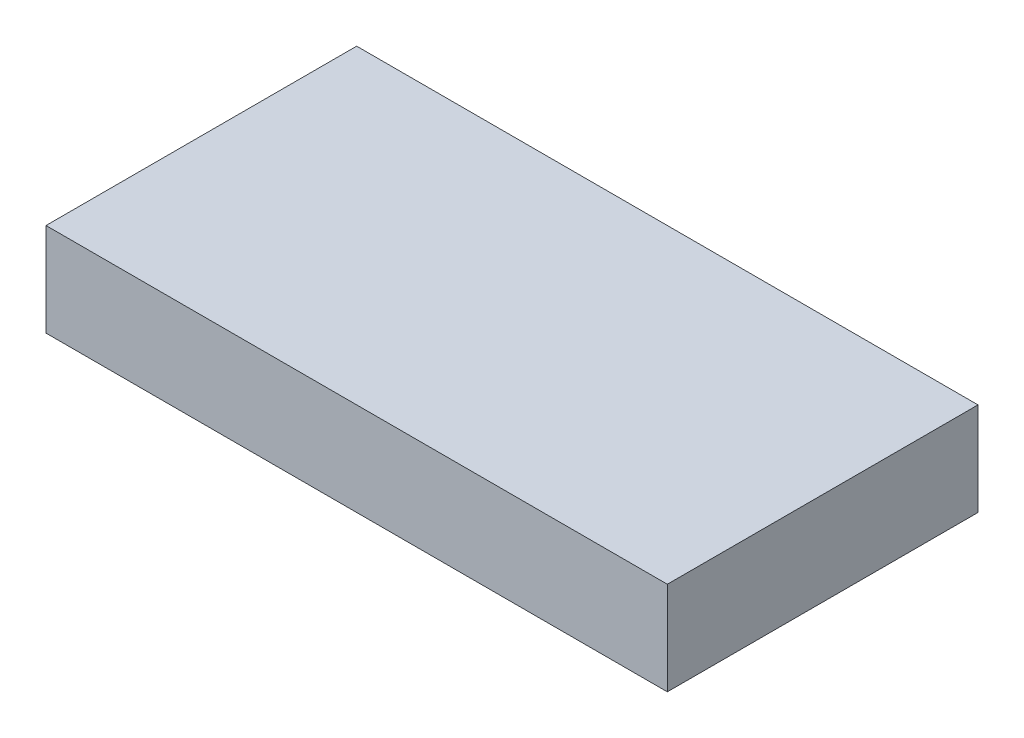
ISO-10303-21;
HEADER;
FILE_DESCRIPTION(('STEP AP214'),'2;1');
FILE_NAME('part.step','',(''),(''),'','','');
FILE_SCHEMA(('AUTOMOTIVE_DESIGN { 1 0 10303 214 1 1 1 1 }'));
ENDSEC;
DATA;
#1=APPLICATION_CONTEXT('core data for automotive mechanical design processes');
#2=APPLICATION_PROTOCOL_DEFINITION('international standard','automotive_design',2000,#1);
#3=PRODUCT_CONTEXT('',#1,'mechanical');
#4=PRODUCT('Part','Part','',(#3));
#5=PRODUCT_RELATED_PRODUCT_CATEGORY('part','',(#4));
#6=PRODUCT_DEFINITION_FORMATION('','',#4);
#7=PRODUCT_DEFINITION_CONTEXT('part definition',#1,'design');
#8=PRODUCT_DEFINITION('design','',#6,#7);
#9=PRODUCT_DEFINITION_SHAPE('','',#8);
#10=(LENGTH_UNIT() NAMED_UNIT(*) SI_UNIT(.MILLI.,.METRE.));
#11=(NAMED_UNIT(*) PLANE_ANGLE_UNIT() SI_UNIT($,.RADIAN.));
#12=(NAMED_UNIT(*) SI_UNIT($,.STERADIAN.) SOLID_ANGLE_UNIT());
#13=UNCERTAINTY_MEASURE_WITH_UNIT(LENGTH_MEASURE(1.E-05),#10,'distance_accuracy_value','');
#14=(GEOMETRIC_REPRESENTATION_CONTEXT(3) GLOBAL_UNCERTAINTY_ASSIGNED_CONTEXT((#13)) GLOBAL_UNIT_ASSIGNED_CONTEXT((#10,
#11,#12)) REPRESENTATION_CONTEXT('',''));
#15=CARTESIAN_POINT('',(0.,0.,0.));
#16=DIRECTION('',(0.,0.,1.));
#17=DIRECTION('',(1.,0.,0.));
#18=AXIS2_PLACEMENT_3D('',#15,#16,#17);
#19=CARTESIAN_POINT('',(5.08,1.524,2.54));
#20=DIRECTION('',(-1.,0.,0.));
#21=DIRECTION('',(0.,0.,1.));
#22=AXIS2_PLACEMENT_3D('',#19,#20,#21);
#23=PLANE('',#22);
#24=DIRECTION('',(0.,0.,-1.));
#25=VECTOR('',#24,1.);
#26=CARTESIAN_POINT('',(5.08,0.,2.54));
#27=LINE('',#26,#25);
#28=CARTESIAN_POINT('',(5.08,0.,2.54));
#29=VERTEX_POINT('',#28);
#30=CARTESIAN_POINT('',(5.08,0.,-2.54));
#31=VERTEX_POINT('',#30);
#32=EDGE_CURVE('E102',#29,#31,#27,.T.);
#33=ORIENTED_EDGE('',*,*,#32,.T.);
#34=DIRECTION('',(0.,-1.,0.));
#35=VECTOR('',#34,1.);
#36=CARTESIAN_POINT('',(5.08,1.524,-2.54));
#37=LINE('',#36,#35);
#38=CARTESIAN_POINT('',(5.08,1.524,-2.54));
#39=VERTEX_POINT('',#38);
#40=EDGE_CURVE('E11',#39,#31,#37,.T.);
#41=ORIENTED_EDGE('',*,*,#40,.F.);
#42=DIRECTION('',(0.,0.,-1.));
#43=VECTOR('',#42,1.);
#44=CARTESIAN_POINT('',(5.08,1.524,2.54));
#45=LINE('',#44,#43);
#46=CARTESIAN_POINT('',(5.08,1.524,2.54));
#47=VERTEX_POINT('',#46);
#48=EDGE_CURVE('E90',#47,#39,#45,.T.);
#49=ORIENTED_EDGE('',*,*,#48,.F.);
#50=DIRECTION('',(0.,-1.,0.));
#51=VECTOR('',#50,1.);
#52=CARTESIAN_POINT('',(5.08,1.524,2.54));
#53=LINE('',#52,#51);
#54=EDGE_CURVE('E98',#47,#29,#53,.T.);
#55=ORIENTED_EDGE('',*,*,#54,.T.);
#56=EDGE_LOOP('',(#33,#41,#49,#55));
#57=FACE_BOUND('',#56,.T.);
#58=ADVANCED_FACE('F39',(#57),#23,.F.);
#59=CARTESIAN_POINT('',(-5.08,1.524,-2.54));
#60=DIRECTION('',(0.,0.,1.));
#61=DIRECTION('',(1.,0.,0.));
#62=AXIS2_PLACEMENT_3D('',#59,#60,#61);
#63=PLANE('',#62);
#64=DIRECTION('',(-1.,0.,0.));
#65=VECTOR('',#64,1.);
#66=CARTESIAN_POINT('',(-5.08,0.,-2.54));
#67=LINE('',#66,#65);
#68=CARTESIAN_POINT('',(-5.08,0.,-2.54));
#69=VERTEX_POINT('',#68);
#70=EDGE_CURVE('E94',#31,#69,#67,.T.);
#71=ORIENTED_EDGE('',*,*,#70,.T.);
#72=DIRECTION('',(0.,-1.,0.));
#73=VECTOR('',#72,1.);
#74=CARTESIAN_POINT('',(-5.08,1.524,-2.54));
#75=LINE('',#74,#73);
#76=CARTESIAN_POINT('',(-5.08,1.524,-2.54));
#77=VERTEX_POINT('',#76);
#78=EDGE_CURVE('E47',#77,#69,#75,.T.);
#79=ORIENTED_EDGE('',*,*,#78,.F.);
#80=DIRECTION('',(-1.,0.,0.));
#81=VECTOR('',#80,1.);
#82=CARTESIAN_POINT('',(-5.08,1.524,-2.54));
#83=LINE('',#82,#81);
#84=EDGE_CURVE('E85',#39,#77,#83,.T.);
#85=ORIENTED_EDGE('',*,*,#84,.F.);
#86=ORIENTED_EDGE('',*,*,#40,.T.);
#87=EDGE_LOOP('',(#71,#79,#85,#86));
#88=FACE_BOUND('',#87,.T.);
#89=ADVANCED_FACE('F93',(#88),#63,.F.);
#90=CARTESIAN_POINT('',(-5.08,1.524,2.54));
#91=DIRECTION('',(1.,0.,0.));
#92=DIRECTION('',(0.,0.,-1.));
#93=AXIS2_PLACEMENT_3D('',#90,#91,#92);
#94=PLANE('',#93);
#95=DIRECTION('',(0.,0.,1.));
#96=VECTOR('',#95,1.);
#97=CARTESIAN_POINT('',(-5.08,0.,2.54));
#98=LINE('',#97,#96);
#99=CARTESIAN_POINT('',(-5.08,0.,2.54));
#100=VERTEX_POINT('',#99);
#101=EDGE_CURVE('E72',#69,#100,#98,.T.);
#102=ORIENTED_EDGE('',*,*,#101,.T.);
#103=DIRECTION('',(0.,-1.,0.));
#104=VECTOR('',#103,1.);
#105=CARTESIAN_POINT('',(-5.08,1.524,2.54));
#106=LINE('',#105,#104);
#107=CARTESIAN_POINT('',(-5.08,1.524,2.54));
#108=VERTEX_POINT('',#107);
#109=EDGE_CURVE('E95',#108,#100,#106,.T.);
#110=ORIENTED_EDGE('',*,*,#109,.F.);
#111=DIRECTION('',(0.,0.,1.));
#112=VECTOR('',#111,1.);
#113=CARTESIAN_POINT('',(-5.08,1.524,2.54));
#114=LINE('',#113,#112);
#115=EDGE_CURVE('E88',#77,#108,#114,.T.);
#116=ORIENTED_EDGE('',*,*,#115,.F.);
#117=ORIENTED_EDGE('',*,*,#78,.T.);
#118=EDGE_LOOP('',(#102,#110,#116,#117));
#119=FACE_BOUND('',#118,.T.);
#120=ADVANCED_FACE('F96',(#119),#94,.F.);
#121=CARTESIAN_POINT('',(-5.08,1.524,2.54));
#122=DIRECTION('',(0.,0.,-1.));
#123=DIRECTION('',(-1.,0.,0.));
#124=AXIS2_PLACEMENT_3D('',#121,#122,#123);
#125=PLANE('',#124);
#126=DIRECTION('',(1.,0.,0.));
#127=VECTOR('',#126,1.);
#128=CARTESIAN_POINT('',(-5.08,0.,2.54));
#129=LINE('',#128,#127);
#130=EDGE_CURVE('E78',#100,#29,#129,.T.);
#131=ORIENTED_EDGE('',*,*,#130,.T.);
#132=ORIENTED_EDGE('',*,*,#54,.F.);
#133=DIRECTION('',(1.,0.,0.));
#134=VECTOR('',#133,1.);
#135=CARTESIAN_POINT('',(-5.08,1.524,2.54));
#136=LINE('',#135,#134);
#137=EDGE_CURVE('E55',#108,#47,#136,.T.);
#138=ORIENTED_EDGE('',*,*,#137,.F.);
#139=ORIENTED_EDGE('',*,*,#109,.T.);
#140=EDGE_LOOP('',(#131,#132,#138,#139));
#141=FACE_BOUND('',#140,.T.);
#142=ADVANCED_FACE('F109',(#141),#125,.F.);
#143=CARTESIAN_POINT('',(0.,1.524,0.));
#144=DIRECTION('',(0.,-1.,0.));
#145=DIRECTION('',(0.,0.,-1.));
#146=AXIS2_PLACEMENT_3D('',#143,#144,#145);
#147=PLANE('',#146);
#148=ORIENTED_EDGE('',*,*,#48,.T.);
#149=ORIENTED_EDGE('',*,*,#84,.T.);
#150=ORIENTED_EDGE('',*,*,#115,.T.);
#151=ORIENTED_EDGE('',*,*,#137,.T.);
#152=EDGE_LOOP('',(#148,#149,#150,#151));
#153=FACE_BOUND('',#152,.T.);
#154=ADVANCED_FACE('F86',(#153),#147,.F.);
#155=CARTESIAN_POINT('',(0.,0.,0.));
#156=DIRECTION('',(0.,-1.,0.));
#157=DIRECTION('',(0.,0.,-1.));
#158=AXIS2_PLACEMENT_3D('',#155,#156,#157);
#159=PLANE('',#158);
#160=ORIENTED_EDGE('',*,*,#32,.F.);
#161=ORIENTED_EDGE('',*,*,#130,.F.);
#162=ORIENTED_EDGE('',*,*,#101,.F.);
#163=ORIENTED_EDGE('',*,*,#70,.F.);
#164=EDGE_LOOP('',(#160,#161,#162,#163));
#165=FACE_BOUND('',#164,.T.);
#166=ADVANCED_FACE('F112',(#165),#159,.T.);
#167=CLOSED_SHELL('',(#58,#89,#120,#142,#154,#166));
#168=MANIFOLD_SOLID_BREP('B2',#167);
#169=ADVANCED_BREP_SHAPE_REPRESENTATION('',(#18,#168),#14);
#170=SHAPE_DEFINITION_REPRESENTATION(#9,#169);
ENDSEC;
END-ISO-10303-21;
